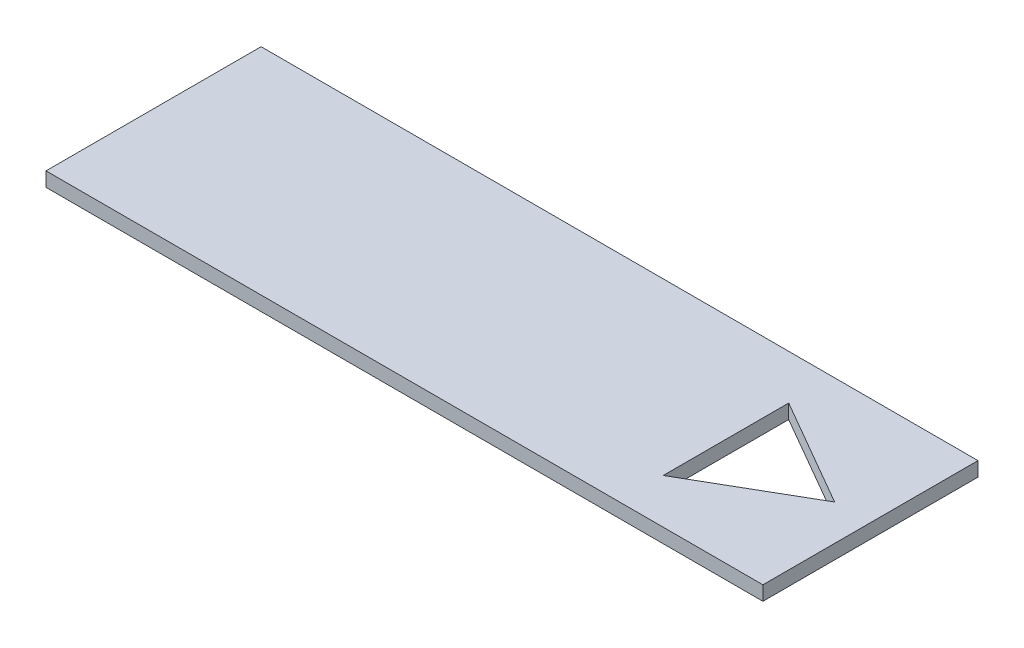
ISO-10303-21;
HEADER;
FILE_DESCRIPTION(('STEP AP214'),'2;1');
FILE_NAME('part.step','',(''),(''),'','','');
FILE_SCHEMA(('AUTOMOTIVE_DESIGN { 1 0 10303 214 1 1 1 1 }'));
ENDSEC;
DATA;
#1=APPLICATION_CONTEXT('core data for automotive mechanical design processes');
#2=APPLICATION_PROTOCOL_DEFINITION('international standard','automotive_design',2000,#1);
#3=PRODUCT_CONTEXT('',#1,'mechanical');
#4=PRODUCT('Part','Part','',(#3));
#5=PRODUCT_RELATED_PRODUCT_CATEGORY('part','',(#4));
#6=PRODUCT_DEFINITION_FORMATION('','',#4);
#7=PRODUCT_DEFINITION_CONTEXT('part definition',#1,'design');
#8=PRODUCT_DEFINITION('design','',#6,#7);
#9=PRODUCT_DEFINITION_SHAPE('','',#8);
#10=(LENGTH_UNIT() NAMED_UNIT(*) SI_UNIT(.MILLI.,.METRE.));
#11=(NAMED_UNIT(*) PLANE_ANGLE_UNIT() SI_UNIT($,.RADIAN.));
#12=(NAMED_UNIT(*) SI_UNIT($,.STERADIAN.) SOLID_ANGLE_UNIT());
#13=UNCERTAINTY_MEASURE_WITH_UNIT(LENGTH_MEASURE(1.E-05),#10,'distance_accuracy_value','');
#14=(GEOMETRIC_REPRESENTATION_CONTEXT(3) GLOBAL_UNCERTAINTY_ASSIGNED_CONTEXT((#13)) GLOBAL_UNIT_ASSIGNED_CONTEXT((#10,
#11,#12)) REPRESENTATION_CONTEXT('',''));
#15=CARTESIAN_POINT('',(0.,0.,0.));
#16=DIRECTION('',(0.,0.,1.));
#17=DIRECTION('',(1.,0.,0.));
#18=AXIS2_PLACEMENT_3D('',#15,#16,#17);
#19=CARTESIAN_POINT('',(0.,4.,0.));
#20=DIRECTION('',(1.,0.,0.));
#21=DIRECTION('',(0.,0.,-1.));
#22=AXIS2_PLACEMENT_3D('',#19,#20,#21);
#23=PLANE('',#22);
#24=DIRECTION('',(0.,0.,1.));
#25=VECTOR('',#24,1.);
#26=CARTESIAN_POINT('',(0.,0.,0.));
#27=LINE('',#26,#25);
#28=CARTESIAN_POINT('',(0.,0.,-60.));
#29=VERTEX_POINT('',#28);
#30=CARTESIAN_POINT('',(0.,0.,0.));
#31=VERTEX_POINT('',#30);
#32=EDGE_CURVE('E117',#29,#31,#27,.T.);
#33=ORIENTED_EDGE('',*,*,#32,.T.);
#34=DIRECTION('',(0.,-1.,0.));
#35=VECTOR('',#34,1.);
#36=CARTESIAN_POINT('',(0.,4.,0.));
#37=LINE('',#36,#35);
#38=CARTESIAN_POINT('',(0.,4.,0.));
#39=VERTEX_POINT('',#38);
#40=EDGE_CURVE('E11',#39,#31,#37,.T.);
#41=ORIENTED_EDGE('',*,*,#40,.F.);
#42=DIRECTION('',(0.,0.,1.));
#43=VECTOR('',#42,1.);
#44=CARTESIAN_POINT('',(0.,4.,0.));
#45=LINE('',#44,#43);
#46=CARTESIAN_POINT('',(0.,4.,-60.));
#47=VERTEX_POINT('',#46);
#48=EDGE_CURVE('E119',#47,#39,#45,.T.);
#49=ORIENTED_EDGE('',*,*,#48,.F.);
#50=DIRECTION('',(0.,-1.,0.));
#51=VECTOR('',#50,1.);
#52=CARTESIAN_POINT('',(0.,4.,-60.));
#53=LINE('',#52,#51);
#54=EDGE_CURVE('E129',#47,#29,#53,.T.);
#55=ORIENTED_EDGE('',*,*,#54,.T.);
#56=EDGE_LOOP('',(#33,#41,#49,#55));
#57=FACE_BOUND('',#56,.T.);
#58=ADVANCED_FACE('F33',(#57),#23,.F.);
#59=CARTESIAN_POINT('',(0.,4.,0.));
#60=DIRECTION('',(0.,0.,-1.));
#61=DIRECTION('',(-1.,0.,0.));
#62=AXIS2_PLACEMENT_3D('',#59,#60,#61);
#63=PLANE('',#62);
#64=DIRECTION('',(1.,0.,0.));
#65=VECTOR('',#64,1.);
#66=CARTESIAN_POINT('',(0.,0.,0.));
#67=LINE('',#66,#65);
#68=CARTESIAN_POINT('',(200.,0.,0.));
#69=VERTEX_POINT('',#68);
#70=EDGE_CURVE('E132',#31,#69,#67,.T.);
#71=ORIENTED_EDGE('',*,*,#70,.T.);
#72=DIRECTION('',(0.,-1.,0.));
#73=VECTOR('',#72,1.);
#74=CARTESIAN_POINT('',(200.,4.,0.));
#75=LINE('',#74,#73);
#76=CARTESIAN_POINT('',(200.,4.,0.));
#77=VERTEX_POINT('',#76);
#78=EDGE_CURVE('E40',#77,#69,#75,.T.);
#79=ORIENTED_EDGE('',*,*,#78,.F.);
#80=DIRECTION('',(1.,0.,0.));
#81=VECTOR('',#80,1.);
#82=CARTESIAN_POINT('',(0.,4.,0.));
#83=LINE('',#82,#81);
#84=EDGE_CURVE('E122',#39,#77,#83,.T.);
#85=ORIENTED_EDGE('',*,*,#84,.F.);
#86=ORIENTED_EDGE('',*,*,#40,.T.);
#87=EDGE_LOOP('',(#71,#79,#85,#86));
#88=FACE_BOUND('',#87,.T.);
#89=ADVANCED_FACE('F160',(#88),#63,.F.);
#90=CARTESIAN_POINT('',(200.,4.,0.));
#91=DIRECTION('',(-1.,0.,0.));
#92=DIRECTION('',(0.,0.,1.));
#93=AXIS2_PLACEMENT_3D('',#90,#91,#92);
#94=PLANE('',#93);
#95=DIRECTION('',(0.,0.,-1.));
#96=VECTOR('',#95,1.);
#97=CARTESIAN_POINT('',(200.,0.,0.));
#98=LINE('',#97,#96);
#99=CARTESIAN_POINT('',(200.,0.,-60.));
#100=VERTEX_POINT('',#99);
#101=EDGE_CURVE('E134',#69,#100,#98,.T.);
#102=ORIENTED_EDGE('',*,*,#101,.T.);
#103=DIRECTION('',(0.,-1.,0.));
#104=VECTOR('',#103,1.);
#105=CARTESIAN_POINT('',(200.,4.,-60.));
#106=LINE('',#105,#104);
#107=CARTESIAN_POINT('',(200.,4.,-60.));
#108=VERTEX_POINT('',#107);
#109=EDGE_CURVE('E139',#108,#100,#106,.T.);
#110=ORIENTED_EDGE('',*,*,#109,.F.);
#111=DIRECTION('',(0.,0.,-1.));
#112=VECTOR('',#111,1.);
#113=CARTESIAN_POINT('',(200.,4.,0.));
#114=LINE('',#113,#112);
#115=EDGE_CURVE('E125',#77,#108,#114,.T.);
#116=ORIENTED_EDGE('',*,*,#115,.F.);
#117=ORIENTED_EDGE('',*,*,#78,.T.);
#118=EDGE_LOOP('',(#102,#110,#116,#117));
#119=FACE_BOUND('',#118,.T.);
#120=ADVANCED_FACE('F146',(#119),#94,.F.);
#121=CARTESIAN_POINT('',(0.,4.,-60.));
#122=DIRECTION('',(0.,0.,1.));
#123=DIRECTION('',(1.,0.,0.));
#124=AXIS2_PLACEMENT_3D('',#121,#122,#123);
#125=PLANE('',#124);
#126=DIRECTION('',(-1.,0.,0.));
#127=VECTOR('',#126,1.);
#128=CARTESIAN_POINT('',(0.,0.,-60.));
#129=LINE('',#128,#127);
#130=EDGE_CURVE('E123',#100,#29,#129,.T.);
#131=ORIENTED_EDGE('',*,*,#130,.T.);
#132=ORIENTED_EDGE('',*,*,#54,.F.);
#133=DIRECTION('',(-1.,0.,0.));
#134=VECTOR('',#133,1.);
#135=CARTESIAN_POINT('',(0.,4.,-60.));
#136=LINE('',#135,#134);
#137=EDGE_CURVE('E127',#108,#47,#136,.T.);
#138=ORIENTED_EDGE('',*,*,#137,.F.);
#139=ORIENTED_EDGE('',*,*,#109,.T.);
#140=EDGE_LOOP('',(#131,#132,#138,#139));
#141=FACE_BOUND('',#140,.T.);
#142=ADVANCED_FACE('F153',(#141),#125,.F.);
#143=CARTESIAN_POINT('',(0.,4.,0.));
#144=DIRECTION('',(0.,-1.,0.));
#145=DIRECTION('',(0.,0.,-1.));
#146=AXIS2_PLACEMENT_3D('',#143,#144,#145);
#147=PLANE('',#146);
#148=DIRECTION('',(-0.866025403784439,0.,-0.5));
#149=VECTOR('',#148,1.);
#150=CARTESIAN_POINT('',(190.,4.,-30.));
#151=LINE('',#150,#149);
#152=CARTESIAN_POINT('',(190.,4.,-30.));
#153=VERTEX_POINT('',#152);
#154=CARTESIAN_POINT('',(159.689110867545,4.,-47.5));
#155=VERTEX_POINT('',#154);
#156=EDGE_CURVE('E109',#153,#155,#151,.T.);
#157=ORIENTED_EDGE('',*,*,#156,.F.);
#158=DIRECTION('',(0.866025403784439,0.,-0.5));
#159=VECTOR('',#158,1.);
#160=CARTESIAN_POINT('',(159.689110867545,4.,-12.5));
#161=LINE('',#160,#159);
#162=CARTESIAN_POINT('',(159.689110867545,4.,-12.5));
#163=VERTEX_POINT('',#162);
#164=EDGE_CURVE('E47',#163,#153,#161,.T.);
#165=ORIENTED_EDGE('',*,*,#164,.F.);
#166=DIRECTION('',(0.,0.,1.));
#167=VECTOR('',#166,1.);
#168=CARTESIAN_POINT('',(159.689110867545,4.,-47.5));
#169=LINE('',#168,#167);
#170=EDGE_CURVE('E106',#155,#163,#169,.T.);
#171=ORIENTED_EDGE('',*,*,#170,.F.);
#172=EDGE_LOOP('',(#157,#165,#171));
#173=FACE_BOUND('',#172,.T.);
#174=ORIENTED_EDGE('',*,*,#48,.T.);
#175=ORIENTED_EDGE('',*,*,#84,.T.);
#176=ORIENTED_EDGE('',*,*,#115,.T.);
#177=ORIENTED_EDGE('',*,*,#137,.T.);
#178=EDGE_LOOP('',(#174,#175,#176,#177));
#179=FACE_BOUND('',#178,.T.);
#180=ADVANCED_FACE('F159',(#173,#179),#147,.F.);
#181=CARTESIAN_POINT('',(0.,0.,0.));
#182=DIRECTION('',(0.,-1.,0.));
#183=DIRECTION('',(0.,0.,-1.));
#184=AXIS2_PLACEMENT_3D('',#181,#182,#183);
#185=PLANE('',#184);
#186=DIRECTION('',(0.866025403784439,0.,-0.5));
#187=VECTOR('',#186,1.);
#188=CARTESIAN_POINT('',(159.689110867545,0.,-12.5));
#189=LINE('',#188,#187);
#190=CARTESIAN_POINT('',(159.689110867545,0.,-12.5));
#191=VERTEX_POINT('',#190);
#192=CARTESIAN_POINT('',(190.,0.,-30.));
#193=VERTEX_POINT('',#192);
#194=EDGE_CURVE('E93',#191,#193,#189,.T.);
#195=ORIENTED_EDGE('',*,*,#194,.T.);
#196=DIRECTION('',(-0.866025403784439,0.,-0.5));
#197=VECTOR('',#196,1.);
#198=CARTESIAN_POINT('',(190.,0.,-30.));
#199=LINE('',#198,#197);
#200=CARTESIAN_POINT('',(159.689110867545,0.,-47.5));
#201=VERTEX_POINT('',#200);
#202=EDGE_CURVE('E100',#193,#201,#199,.T.);
#203=ORIENTED_EDGE('',*,*,#202,.T.);
#204=DIRECTION('',(0.,0.,1.));
#205=VECTOR('',#204,1.);
#206=CARTESIAN_POINT('',(159.689110867545,0.,-47.5));
#207=LINE('',#206,#205);
#208=EDGE_CURVE('E55',#201,#191,#207,.T.);
#209=ORIENTED_EDGE('',*,*,#208,.T.);
#210=EDGE_LOOP('',(#195,#203,#209));
#211=FACE_BOUND('',#210,.T.);
#212=ORIENTED_EDGE('',*,*,#32,.F.);
#213=ORIENTED_EDGE('',*,*,#130,.F.);
#214=ORIENTED_EDGE('',*,*,#101,.F.);
#215=ORIENTED_EDGE('',*,*,#70,.F.);
#216=EDGE_LOOP('',(#212,#213,#214,#215));
#217=FACE_BOUND('',#216,.T.);
#218=ADVANCED_FACE('F104',(#211,#217),#185,.T.);
#219=CARTESIAN_POINT('',(159.689110867545,0.,-12.5));
#220=DIRECTION('',(0.5,0.,0.866025403784439));
#221=DIRECTION('',(0.866025403784439,0.,-0.5));
#222=AXIS2_PLACEMENT_3D('',#219,#220,#221);
#223=PLANE('',#222);
#224=ORIENTED_EDGE('',*,*,#164,.T.);
#225=DIRECTION('',(0.,1.,0.));
#226=VECTOR('',#225,1.);
#227=CARTESIAN_POINT('',(190.,0.,-30.));
#228=LINE('',#227,#226);
#229=EDGE_CURVE('E89',#193,#153,#228,.T.);
#230=ORIENTED_EDGE('',*,*,#229,.F.);
#231=ORIENTED_EDGE('',*,*,#194,.F.);
#232=DIRECTION('',(0.,1.,0.));
#233=VECTOR('',#232,1.);
#234=CARTESIAN_POINT('',(159.689110867545,0.,-12.5));
#235=LINE('',#234,#233);
#236=EDGE_CURVE('E115',#191,#163,#235,.T.);
#237=ORIENTED_EDGE('',*,*,#236,.T.);
#238=EDGE_LOOP('',(#224,#230,#231,#237));
#239=FACE_BOUND('',#238,.T.);
#240=ADVANCED_FACE('F91',(#239),#223,.F.);
#241=CARTESIAN_POINT('',(159.689110867545,0.,-47.5));
#242=DIRECTION('',(-1.,0.,0.));
#243=DIRECTION('',(0.,0.,1.));
#244=AXIS2_PLACEMENT_3D('',#241,#242,#243);
#245=PLANE('',#244);
#246=ORIENTED_EDGE('',*,*,#170,.T.);
#247=ORIENTED_EDGE('',*,*,#236,.F.);
#248=ORIENTED_EDGE('',*,*,#208,.F.);
#249=DIRECTION('',(0.,1.,0.));
#250=VECTOR('',#249,1.);
#251=CARTESIAN_POINT('',(159.689110867545,0.,-47.5));
#252=LINE('',#251,#250);
#253=EDGE_CURVE('E97',#201,#155,#252,.T.);
#254=ORIENTED_EDGE('',*,*,#253,.T.);
#255=EDGE_LOOP('',(#246,#247,#248,#254));
#256=FACE_BOUND('',#255,.T.);
#257=ADVANCED_FACE('F177',(#256),#245,.F.);
#258=CARTESIAN_POINT('',(190.,0.,-30.));
#259=DIRECTION('',(0.5,0.,-0.866025403784439));
#260=DIRECTION('',(-0.866025403784439,0.,-0.5));
#261=AXIS2_PLACEMENT_3D('',#258,#259,#260);
#262=PLANE('',#261);
#263=ORIENTED_EDGE('',*,*,#156,.T.);
#264=ORIENTED_EDGE('',*,*,#253,.F.);
#265=ORIENTED_EDGE('',*,*,#202,.F.);
#266=ORIENTED_EDGE('',*,*,#229,.T.);
#267=EDGE_LOOP('',(#263,#264,#265,#266));
#268=FACE_BOUND('',#267,.T.);
#269=ADVANCED_FACE('F101',(#268),#262,.F.);
#270=CLOSED_SHELL('',(#58,#89,#120,#142,#180,#218,#240,#257,#269));
#271=MANIFOLD_SOLID_BREP('B2',#270);
#272=ADVANCED_BREP_SHAPE_REPRESENTATION('',(#18,#271),#14);
#273=SHAPE_DEFINITION_REPRESENTATION(#9,#272);
ENDSEC;
END-ISO-10303-21;
